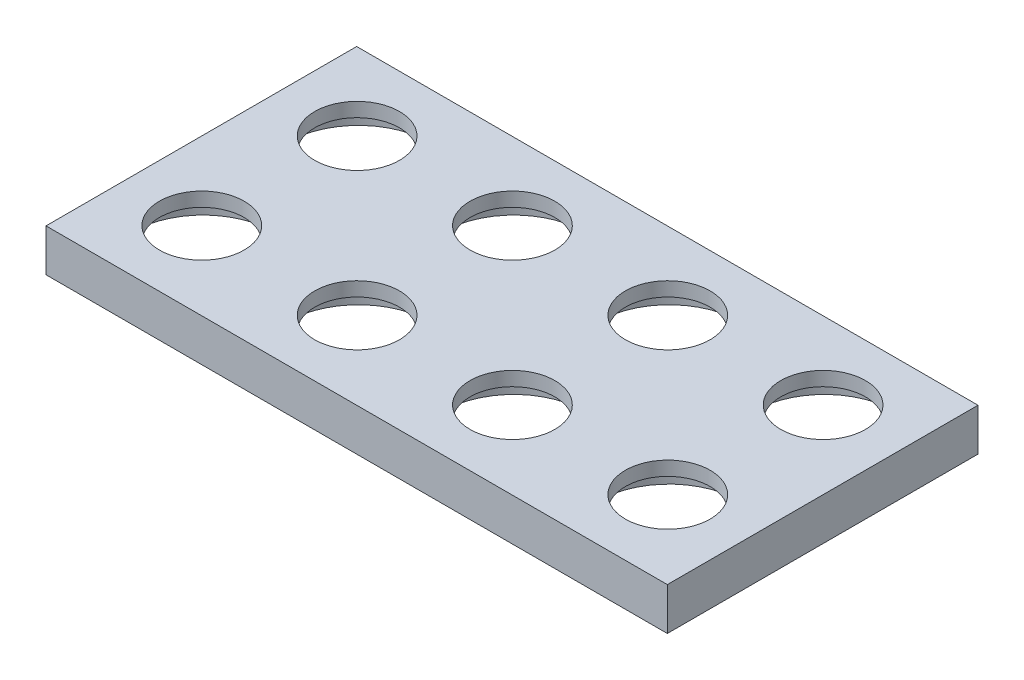
ISO-10303-21;
HEADER;
FILE_DESCRIPTION(('STEP AP214'),'2;1');
FILE_NAME('part.step','',(''),(''),'','','');
FILE_SCHEMA(('AUTOMOTIVE_DESIGN { 1 0 10303 214 1 1 1 1 }'));
ENDSEC;
DATA;
#1=APPLICATION_CONTEXT('core data for automotive mechanical design processes');
#2=APPLICATION_PROTOCOL_DEFINITION('international standard','automotive_design',2000,#1);
#3=PRODUCT_CONTEXT('',#1,'mechanical');
#4=PRODUCT('Part','Part','',(#3));
#5=PRODUCT_RELATED_PRODUCT_CATEGORY('part','',(#4));
#6=PRODUCT_DEFINITION_FORMATION('','',#4);
#7=PRODUCT_DEFINITION_CONTEXT('part definition',#1,'design');
#8=PRODUCT_DEFINITION('design','',#6,#7);
#9=PRODUCT_DEFINITION_SHAPE('','',#8);
#10=(LENGTH_UNIT() NAMED_UNIT(*) SI_UNIT(.MILLI.,.METRE.));
#11=(NAMED_UNIT(*) PLANE_ANGLE_UNIT() SI_UNIT($,.RADIAN.));
#12=(NAMED_UNIT(*) SI_UNIT($,.STERADIAN.) SOLID_ANGLE_UNIT());
#13=UNCERTAINTY_MEASURE_WITH_UNIT(LENGTH_MEASURE(1.E-05),#10,'distance_accuracy_value','');
#14=(GEOMETRIC_REPRESENTATION_CONTEXT(3) GLOBAL_UNCERTAINTY_ASSIGNED_CONTEXT((#13)) GLOBAL_UNIT_ASSIGNED_CONTEXT((#10,
#11,#12)) REPRESENTATION_CONTEXT('',''));
#15=CARTESIAN_POINT('',(0.,0.,0.));
#16=DIRECTION('',(0.,0.,1.));
#17=DIRECTION('',(1.,0.,0.));
#18=AXIS2_PLACEMENT_3D('',#15,#16,#17);
#19=CARTESIAN_POINT('',(22.,-6.,0.));
#20=DIRECTION('',(1.,0.,0.));
#21=DIRECTION('',(0.,0.,-1.));
#22=AXIS2_PLACEMENT_3D('',#19,#20,#21);
#23=PLANE('',#22);
#24=DIRECTION('',(0.,0.,-1.));
#25=VECTOR('',#24,1.);
#26=CARTESIAN_POINT('',(22.,0.,0.));
#27=LINE('',#26,#25);
#28=CARTESIAN_POINT('',(22.,0.,0.));
#29=VERTEX_POINT('',#28);
#30=CARTESIAN_POINT('',(22.,0.,-44.));
#31=VERTEX_POINT('',#30);
#32=EDGE_CURVE('E170',#29,#31,#27,.T.);
#33=ORIENTED_EDGE('',*,*,#32,.F.);
#34=DIRECTION('',(0.,1.,0.));
#35=VECTOR('',#34,1.);
#36=CARTESIAN_POINT('',(22.,-6.,0.));
#37=LINE('',#36,#35);
#38=CARTESIAN_POINT('',(22.,-6.,0.));
#39=VERTEX_POINT('',#38);
#40=EDGE_CURVE('E11',#39,#29,#37,.T.);
#41=ORIENTED_EDGE('',*,*,#40,.F.);
#42=DIRECTION('',(0.,0.,-1.));
#43=VECTOR('',#42,1.);
#44=CARTESIAN_POINT('',(22.,-6.,0.));
#45=LINE('',#44,#43);
#46=CARTESIAN_POINT('',(22.,-6.,-44.));
#47=VERTEX_POINT('',#46);
#48=EDGE_CURVE('E42',#39,#47,#45,.T.);
#49=ORIENTED_EDGE('',*,*,#48,.T.);
#50=DIRECTION('',(0.,1.,0.));
#51=VECTOR('',#50,1.);
#52=CARTESIAN_POINT('',(22.,-6.,-44.));
#53=LINE('',#52,#51);
#54=EDGE_CURVE('E89',#47,#31,#53,.T.);
#55=ORIENTED_EDGE('',*,*,#54,.T.);
#56=EDGE_LOOP('',(#33,#41,#49,#55));
#57=FACE_BOUND('',#56,.T.);
#58=ADVANCED_FACE('F33',(#57),#23,.T.);
#59=CARTESIAN_POINT('',(0.,-6.,0.));
#60=DIRECTION('',(0.,0.,1.));
#61=DIRECTION('',(1.,0.,0.));
#62=AXIS2_PLACEMENT_3D('',#59,#60,#61);
#63=PLANE('',#62);
#64=DIRECTION('',(1.,0.,0.));
#65=VECTOR('',#64,1.);
#66=CARTESIAN_POINT('',(0.,0.,0.));
#67=LINE('',#66,#65);
#68=CARTESIAN_POINT('',(-66.,0.,0.));
#69=VERTEX_POINT('',#68);
#70=EDGE_CURVE('E168',#69,#29,#67,.T.);
#71=ORIENTED_EDGE('',*,*,#70,.F.);
#72=DIRECTION('',(0.,1.,0.));
#73=VECTOR('',#72,1.);
#74=CARTESIAN_POINT('',(-66.,-6.,0.));
#75=LINE('',#74,#73);
#76=CARTESIAN_POINT('',(-66.,-6.,0.));
#77=VERTEX_POINT('',#76);
#78=EDGE_CURVE('E79',#77,#69,#75,.T.);
#79=ORIENTED_EDGE('',*,*,#78,.F.);
#80=DIRECTION('',(1.,0.,0.));
#81=VECTOR('',#80,1.);
#82=CARTESIAN_POINT('',(0.,-6.,0.));
#83=LINE('',#82,#81);
#84=EDGE_CURVE('E74',#77,#39,#83,.T.);
#85=ORIENTED_EDGE('',*,*,#84,.T.);
#86=ORIENTED_EDGE('',*,*,#40,.T.);
#87=EDGE_LOOP('',(#71,#79,#85,#86));
#88=FACE_BOUND('',#87,.T.);
#89=ADVANCED_FACE('F35',(#88),#63,.T.);
#90=CARTESIAN_POINT('',(0.,-6.,0.));
#91=DIRECTION('',(0.,-1.,0.));
#92=DIRECTION('',(0.,0.,-1.));
#93=AXIS2_PLACEMENT_3D('',#90,#91,#92);
#94=PLANE('',#93);
#95=CARTESIAN_POINT('',(-11.,-6.,-33.253914961145));
#96=DIRECTION('',(0.,-1.,0.));
#97=DIRECTION('',(0.,0.,-1.));
#98=AXIS2_PLACEMENT_3D('',#95,#96,#97);
#99=CIRCLE('',#98,10.175);
#100=CARTESIAN_POINT('',(-11.,-6.,-43.428914961145));
#101=VERTEX_POINT('',#100);
#102=EDGE_CURVE('E303',#101,#101,#99,.T.);
#103=ORIENTED_EDGE('',*,*,#102,.F.);
#104=EDGE_LOOP('',(#103));
#105=FACE_BOUND('',#104,.T.);
#106=CARTESIAN_POINT('',(-33.,-6.,-33.253914961145));
#107=DIRECTION('',(0.,-1.,0.));
#108=DIRECTION('',(0.,0.,-1.));
#109=AXIS2_PLACEMENT_3D('',#106,#107,#108);
#110=CIRCLE('',#109,10.175);
#111=CARTESIAN_POINT('',(-33.,-6.,-43.428914961145));
#112=VERTEX_POINT('',#111);
#113=EDGE_CURVE('E324',#112,#112,#110,.T.);
#114=ORIENTED_EDGE('',*,*,#113,.F.);
#115=EDGE_LOOP('',(#114));
#116=FACE_BOUND('',#115,.T.);
#117=CARTESIAN_POINT('',(-55.,-6.,-33.253914961145));
#118=DIRECTION('',(0.,-1.,0.));
#119=DIRECTION('',(0.,0.,-1.));
#120=AXIS2_PLACEMENT_3D('',#117,#118,#119);
#121=CIRCLE('',#120,10.175);
#122=CARTESIAN_POINT('',(-55.,-6.,-43.428914961145));
#123=VERTEX_POINT('',#122);
#124=EDGE_CURVE('E306',#123,#123,#121,.T.);
#125=ORIENTED_EDGE('',*,*,#124,.F.);
#126=EDGE_LOOP('',(#125));
#127=FACE_BOUND('',#126,.T.);
#128=DIRECTION('',(0.,0.,1.));
#129=VECTOR('',#128,1.);
#130=CARTESIAN_POINT('',(-66.,-6.,0.));
#131=LINE('',#130,#129);
#132=CARTESIAN_POINT('',(-66.,-6.,-44.));
#133=VERTEX_POINT('',#132);
#134=EDGE_CURVE('E68',#133,#77,#131,.T.);
#135=ORIENTED_EDGE('',*,*,#134,.F.);
#136=DIRECTION('',(-1.,0.,0.));
#137=VECTOR('',#136,1.);
#138=CARTESIAN_POINT('',(0.,-6.,-44.));
#139=LINE('',#138,#137);
#140=EDGE_CURVE('E72',#47,#133,#139,.T.);
#141=ORIENTED_EDGE('',*,*,#140,.F.);
#142=ORIENTED_EDGE('',*,*,#48,.F.);
#143=ORIENTED_EDGE('',*,*,#84,.F.);
#144=EDGE_LOOP('',(#135,#141,#142,#143));
#145=FACE_BOUND('',#144,.T.);
#146=CARTESIAN_POINT('',(11.,-6.,-33.253914961145));
#147=DIRECTION('',(0.,-1.,0.));
#148=DIRECTION('',(0.,0.,-1.));
#149=AXIS2_PLACEMENT_3D('',#146,#147,#148);
#150=CIRCLE('',#149,10.175);
#151=CARTESIAN_POINT('',(11.,-6.,-43.428914961145));
#152=VERTEX_POINT('',#151);
#153=EDGE_CURVE('E95',#152,#152,#150,.T.);
#154=ORIENTED_EDGE('',*,*,#153,.F.);
#155=EDGE_LOOP('',(#154));
#156=FACE_BOUND('',#155,.T.);
#157=CARTESIAN_POINT('',(-11.,-6.,-11.253914961145));
#158=DIRECTION('',(0.,-1.,0.));
#159=DIRECTION('',(0.,0.,-1.));
#160=AXIS2_PLACEMENT_3D('',#157,#158,#159);
#161=CIRCLE('',#160,10.175);
#162=CARTESIAN_POINT('',(-11.,-6.,-21.428914961145));
#163=VERTEX_POINT('',#162);
#164=EDGE_CURVE('E123',#163,#163,#161,.T.);
#165=ORIENTED_EDGE('',*,*,#164,.F.);
#166=EDGE_LOOP('',(#165));
#167=FACE_BOUND('',#166,.T.);
#168=CARTESIAN_POINT('',(-33.,-6.,-11.253914961145));
#169=DIRECTION('',(0.,-1.,0.));
#170=DIRECTION('',(0.,0.,-1.));
#171=AXIS2_PLACEMENT_3D('',#168,#169,#170);
#172=CIRCLE('',#171,10.175);
#173=CARTESIAN_POINT('',(-33.,-6.,-21.428914961145));
#174=VERTEX_POINT('',#173);
#175=EDGE_CURVE('E129',#174,#174,#172,.T.);
#176=ORIENTED_EDGE('',*,*,#175,.F.);
#177=EDGE_LOOP('',(#176));
#178=FACE_BOUND('',#177,.T.);
#179=CARTESIAN_POINT('',(-55.,-6.,-11.253914961145));
#180=DIRECTION('',(0.,-1.,0.));
#181=DIRECTION('',(0.,0.,-1.));
#182=AXIS2_PLACEMENT_3D('',#179,#180,#181);
#183=CIRCLE('',#182,10.175);
#184=CARTESIAN_POINT('',(-55.,-6.,-21.428914961145));
#185=VERTEX_POINT('',#184);
#186=EDGE_CURVE('E118',#185,#185,#183,.T.);
#187=ORIENTED_EDGE('',*,*,#186,.F.);
#188=EDGE_LOOP('',(#187));
#189=FACE_BOUND('',#188,.T.);
#190=CARTESIAN_POINT('',(11.,-6.,-11.253914961145));
#191=DIRECTION('',(0.,-1.,0.));
#192=DIRECTION('',(0.,0.,-1.));
#193=AXIS2_PLACEMENT_3D('',#190,#191,#192);
#194=CIRCLE('',#193,10.175);
#195=CARTESIAN_POINT('',(11.,-6.,-21.428914961145));
#196=VERTEX_POINT('',#195);
#197=EDGE_CURVE('E156',#196,#196,#194,.T.);
#198=ORIENTED_EDGE('',*,*,#197,.F.);
#199=EDGE_LOOP('',(#198));
#200=FACE_BOUND('',#199,.T.);
#201=ADVANCED_FACE('F70',(#105,#116,#127,#145,#156,#167,#178,#189,#200),#94,.T.);
#202=CARTESIAN_POINT('',(0.,0.,0.));
#203=DIRECTION('',(0.,-1.,0.));
#204=DIRECTION('',(0.,0.,-1.));
#205=AXIS2_PLACEMENT_3D('',#202,#203,#204);
#206=PLANE('',#205);
#207=CARTESIAN_POINT('',(-11.,0.,-33.0622247672438));
#208=DIRECTION('',(0.,1.,0.));
#209=DIRECTION('',(0.,0.,1.));
#210=AXIS2_PLACEMENT_3D('',#207,#208,#209);
#211=CIRCLE('',#210,6.);
#212=CARTESIAN_POINT('',(-11.,0.,-27.0622247672438));
#213=VERTEX_POINT('',#212);
#214=EDGE_CURVE('E96',#213,#213,#211,.T.);
#215=ORIENTED_EDGE('',*,*,#214,.F.);
#216=EDGE_LOOP('',(#215));
#217=FACE_BOUND('',#216,.T.);
#218=CARTESIAN_POINT('',(-33.,0.,-33.0622247672438));
#219=DIRECTION('',(0.,1.,0.));
#220=DIRECTION('',(0.,0.,1.));
#221=AXIS2_PLACEMENT_3D('',#218,#219,#220);
#222=CIRCLE('',#221,6.);
#223=CARTESIAN_POINT('',(-33.,0.,-27.0622247672438));
#224=VERTEX_POINT('',#223);
#225=EDGE_CURVE('E102',#224,#224,#222,.T.);
#226=ORIENTED_EDGE('',*,*,#225,.F.);
#227=EDGE_LOOP('',(#226));
#228=FACE_BOUND('',#227,.T.);
#229=CARTESIAN_POINT('',(-55.,0.,-33.0622247672438));
#230=DIRECTION('',(0.,1.,0.));
#231=DIRECTION('',(0.,0.,1.));
#232=AXIS2_PLACEMENT_3D('',#229,#230,#231);
#233=CIRCLE('',#232,6.);
#234=CARTESIAN_POINT('',(-55.,0.,-27.0622247672438));
#235=VERTEX_POINT('',#234);
#236=EDGE_CURVE('E106',#235,#235,#233,.T.);
#237=ORIENTED_EDGE('',*,*,#236,.F.);
#238=EDGE_LOOP('',(#237));
#239=FACE_BOUND('',#238,.T.);
#240=DIRECTION('',(-1.,0.,0.));
#241=VECTOR('',#240,1.);
#242=CARTESIAN_POINT('',(0.,0.,-44.));
#243=LINE('',#242,#241);
#244=CARTESIAN_POINT('',(-66.,0.,-44.));
#245=VERTEX_POINT('',#244);
#246=EDGE_CURVE('E90',#31,#245,#243,.T.);
#247=ORIENTED_EDGE('',*,*,#246,.T.);
#248=DIRECTION('',(0.,0.,1.));
#249=VECTOR('',#248,1.);
#250=CARTESIAN_POINT('',(-66.,0.,0.));
#251=LINE('',#250,#249);
#252=EDGE_CURVE('E80',#245,#69,#251,.T.);
#253=ORIENTED_EDGE('',*,*,#252,.T.);
#254=ORIENTED_EDGE('',*,*,#70,.T.);
#255=ORIENTED_EDGE('',*,*,#32,.T.);
#256=EDGE_LOOP('',(#247,#253,#254,#255));
#257=FACE_BOUND('',#256,.T.);
#258=CARTESIAN_POINT('',(11.,0.,-33.0622247672438));
#259=DIRECTION('',(0.,1.,0.));
#260=DIRECTION('',(0.,0.,1.));
#261=AXIS2_PLACEMENT_3D('',#258,#259,#260);
#262=CIRCLE('',#261,6.);
#263=CARTESIAN_POINT('',(11.,0.,-27.0622247672438));
#264=VERTEX_POINT('',#263);
#265=EDGE_CURVE('E113',#264,#264,#262,.T.);
#266=ORIENTED_EDGE('',*,*,#265,.F.);
#267=EDGE_LOOP('',(#266));
#268=FACE_BOUND('',#267,.T.);
#269=CARTESIAN_POINT('',(-11.,0.,-11.0622247672438));
#270=DIRECTION('',(0.,1.,0.));
#271=DIRECTION('',(0.,0.,1.));
#272=AXIS2_PLACEMENT_3D('',#269,#270,#271);
#273=CIRCLE('',#272,6.);
#274=CARTESIAN_POINT('',(-11.,0.,-5.06222476724382));
#275=VERTEX_POINT('',#274);
#276=EDGE_CURVE('E140',#275,#275,#273,.T.);
#277=ORIENTED_EDGE('',*,*,#276,.F.);
#278=EDGE_LOOP('',(#277));
#279=FACE_BOUND('',#278,.T.);
#280=CARTESIAN_POINT('',(-33.,0.,-11.0622247672438));
#281=DIRECTION('',(0.,1.,0.));
#282=DIRECTION('',(0.,0.,1.));
#283=AXIS2_PLACEMENT_3D('',#280,#281,#282);
#284=CIRCLE('',#283,6.);
#285=CARTESIAN_POINT('',(-33.,0.,-5.06222476724382));
#286=VERTEX_POINT('',#285);
#287=EDGE_CURVE('E143',#286,#286,#284,.T.);
#288=ORIENTED_EDGE('',*,*,#287,.F.);
#289=EDGE_LOOP('',(#288));
#290=FACE_BOUND('',#289,.T.);
#291=CARTESIAN_POINT('',(-55.,0.,-11.0622247672438));
#292=DIRECTION('',(0.,1.,0.));
#293=DIRECTION('',(0.,0.,1.));
#294=AXIS2_PLACEMENT_3D('',#291,#292,#293);
#295=CIRCLE('',#294,6.);
#296=CARTESIAN_POINT('',(-55.,0.,-5.06222476724381));
#297=VERTEX_POINT('',#296);
#298=EDGE_CURVE('E149',#297,#297,#295,.T.);
#299=ORIENTED_EDGE('',*,*,#298,.F.);
#300=EDGE_LOOP('',(#299));
#301=FACE_BOUND('',#300,.T.);
#302=CARTESIAN_POINT('',(11.,0.,-11.0622247672438));
#303=DIRECTION('',(0.,1.,0.));
#304=DIRECTION('',(0.,0.,1.));
#305=AXIS2_PLACEMENT_3D('',#302,#303,#304);
#306=CIRCLE('',#305,6.);
#307=CARTESIAN_POINT('',(11.,0.,-5.06222476724383));
#308=VERTEX_POINT('',#307);
#309=EDGE_CURVE('E165',#308,#308,#306,.T.);
#310=ORIENTED_EDGE('',*,*,#309,.F.);
#311=EDGE_LOOP('',(#310));
#312=FACE_BOUND('',#311,.T.);
#313=ADVANCED_FACE('F174',(#217,#228,#239,#257,#268,#279,#290,#301,#312),#206,.F.);
#314=CARTESIAN_POINT('',(11.,-2.,-11.0622247672438));
#315=DIRECTION('',(0.,1.,0.));
#316=DIRECTION('',(0.,0.,1.));
#317=AXIS2_PLACEMENT_3D('',#314,#315,#316);
#318=CYLINDRICAL_SURFACE('',#317,6.);
#319=CARTESIAN_POINT('',(11.,-2.,-11.0622247672438));
#320=DIRECTION('',(0.,1.,0.));
#321=DIRECTION('',(0.,0.,1.));
#322=AXIS2_PLACEMENT_3D('',#319,#320,#321);
#323=CIRCLE('',#322,6.);
#324=CARTESIAN_POINT('',(11.,-2.,-5.06222476724383));
#325=VERTEX_POINT('',#324);
#326=EDGE_CURVE('E160',#325,#325,#323,.T.);
#327=ORIENTED_EDGE('',*,*,#326,.F.);
#328=EDGE_LOOP('',(#327));
#329=FACE_BOUND('',#328,.T.);
#330=ORIENTED_EDGE('',*,*,#309,.T.);
#331=EDGE_LOOP('',(#330));
#332=FACE_BOUND('',#331,.T.);
#333=ADVANCED_FACE('F188',(#329,#332),#318,.F.);
#334=CARTESIAN_POINT('',(11.,-2.,-11.253914961145));
#335=DIRECTION('',(0.,-1.,0.));
#336=DIRECTION('',(0.,0.,-1.));
#337=AXIS2_PLACEMENT_3D('',#334,#335,#336);
#338=PLANE('',#337);
#339=CARTESIAN_POINT('',(11.,-2.,-11.253914961145));
#340=DIRECTION('',(0.,-1.,0.));
#341=DIRECTION('',(0.,0.,-1.));
#342=AXIS2_PLACEMENT_3D('',#339,#340,#341);
#343=CIRCLE('',#342,10.175);
#344=CARTESIAN_POINT('',(11.,-2.,-21.428914961145));
#345=VERTEX_POINT('',#344);
#346=EDGE_CURVE('E157',#345,#345,#343,.T.);
#347=ORIENTED_EDGE('',*,*,#346,.T.);
#348=EDGE_LOOP('',(#347));
#349=FACE_BOUND('',#348,.T.);
#350=ORIENTED_EDGE('',*,*,#326,.T.);
#351=EDGE_LOOP('',(#350));
#352=FACE_BOUND('',#351,.T.);
#353=ADVANCED_FACE('F193',(#349,#352),#338,.T.);
#354=CARTESIAN_POINT('',(11.,-2.,-11.253914961145));
#355=DIRECTION('',(0.,-1.,0.));
#356=DIRECTION('',(0.,0.,-1.));
#357=AXIS2_PLACEMENT_3D('',#354,#355,#356);
#358=CYLINDRICAL_SURFACE('',#357,10.175);
#359=ORIENTED_EDGE('',*,*,#346,.F.);
#360=EDGE_LOOP('',(#359));
#361=FACE_BOUND('',#360,.T.);
#362=ORIENTED_EDGE('',*,*,#197,.T.);
#363=EDGE_LOOP('',(#362));
#364=FACE_BOUND('',#363,.T.);
#365=ADVANCED_FACE('F195',(#361,#364),#358,.F.);
#366=CARTESIAN_POINT('',(-66.,-6.,0.));
#367=DIRECTION('',(-1.,0.,0.));
#368=DIRECTION('',(0.,0.,1.));
#369=AXIS2_PLACEMENT_3D('',#366,#367,#368);
#370=PLANE('',#369);
#371=ORIENTED_EDGE('',*,*,#252,.F.);
#372=DIRECTION('',(0.,1.,0.));
#373=VECTOR('',#372,1.);
#374=CARTESIAN_POINT('',(-66.,-6.,-44.));
#375=LINE('',#374,#373);
#376=EDGE_CURVE('E87',#133,#245,#375,.T.);
#377=ORIENTED_EDGE('',*,*,#376,.F.);
#378=ORIENTED_EDGE('',*,*,#134,.T.);
#379=ORIENTED_EDGE('',*,*,#78,.T.);
#380=EDGE_LOOP('',(#371,#377,#378,#379));
#381=FACE_BOUND('',#380,.T.);
#382=ADVANCED_FACE('F92',(#381),#370,.T.);
#383=CARTESIAN_POINT('',(-55.,-2.,-11.0622247672438));
#384=DIRECTION('',(0.,1.,0.));
#385=DIRECTION('',(0.,0.,1.));
#386=AXIS2_PLACEMENT_3D('',#383,#384,#385);
#387=CYLINDRICAL_SURFACE('',#386,6.);
#388=CARTESIAN_POINT('',(-55.,-2.,-11.0622247672438));
#389=DIRECTION('',(0.,1.,0.));
#390=DIRECTION('',(0.,0.,1.));
#391=AXIS2_PLACEMENT_3D('',#388,#389,#390);
#392=CIRCLE('',#391,6.);
#393=CARTESIAN_POINT('',(-55.,-2.,-5.06222476724381));
#394=VERTEX_POINT('',#393);
#395=EDGE_CURVE('E146',#394,#394,#392,.T.);
#396=ORIENTED_EDGE('',*,*,#395,.F.);
#397=EDGE_LOOP('',(#396));
#398=FACE_BOUND('',#397,.T.);
#399=ORIENTED_EDGE('',*,*,#298,.T.);
#400=EDGE_LOOP('',(#399));
#401=FACE_BOUND('',#400,.T.);
#402=ADVANCED_FACE('F204',(#398,#401),#387,.F.);
#403=CARTESIAN_POINT('',(-33.,-2.,-11.0622247672438));
#404=DIRECTION('',(0.,1.,0.));
#405=DIRECTION('',(0.,0.,1.));
#406=AXIS2_PLACEMENT_3D('',#403,#404,#405);
#407=CYLINDRICAL_SURFACE('',#406,6.);
#408=CARTESIAN_POINT('',(-33.,-2.,-11.0622247672438));
#409=DIRECTION('',(0.,1.,0.));
#410=DIRECTION('',(0.,0.,1.));
#411=AXIS2_PLACEMENT_3D('',#408,#409,#410);
#412=CIRCLE('',#411,6.);
#413=CARTESIAN_POINT('',(-33.,-2.,-5.06222476724382));
#414=VERTEX_POINT('',#413);
#415=EDGE_CURVE('E139',#414,#414,#412,.T.);
#416=ORIENTED_EDGE('',*,*,#415,.F.);
#417=EDGE_LOOP('',(#416));
#418=FACE_BOUND('',#417,.T.);
#419=ORIENTED_EDGE('',*,*,#287,.T.);
#420=EDGE_LOOP('',(#419));
#421=FACE_BOUND('',#420,.T.);
#422=ADVANCED_FACE('F207',(#418,#421),#407,.F.);
#423=CARTESIAN_POINT('',(-11.,-2.,-11.0622247672438));
#424=DIRECTION('',(0.,1.,0.));
#425=DIRECTION('',(0.,0.,1.));
#426=AXIS2_PLACEMENT_3D('',#423,#424,#425);
#427=CYLINDRICAL_SURFACE('',#426,6.);
#428=CARTESIAN_POINT('',(-11.,-2.,-11.0622247672438));
#429=DIRECTION('',(0.,1.,0.));
#430=DIRECTION('',(0.,0.,1.));
#431=AXIS2_PLACEMENT_3D('',#428,#429,#430);
#432=CIRCLE('',#431,6.);
#433=CARTESIAN_POINT('',(-11.,-2.,-5.06222476724382));
#434=VERTEX_POINT('',#433);
#435=EDGE_CURVE('E122',#434,#434,#432,.T.);
#436=ORIENTED_EDGE('',*,*,#435,.F.);
#437=EDGE_LOOP('',(#436));
#438=FACE_BOUND('',#437,.T.);
#439=ORIENTED_EDGE('',*,*,#276,.T.);
#440=EDGE_LOOP('',(#439));
#441=FACE_BOUND('',#440,.T.);
#442=ADVANCED_FACE('F211',(#438,#441),#427,.F.);
#443=CARTESIAN_POINT('',(-55.,-2.,-11.253914961145));
#444=DIRECTION('',(0.,-1.,0.));
#445=DIRECTION('',(0.,0.,-1.));
#446=AXIS2_PLACEMENT_3D('',#443,#444,#445);
#447=PLANE('',#446);
#448=CARTESIAN_POINT('',(-55.,-2.,-11.253914961145));
#449=DIRECTION('',(0.,-1.,0.));
#450=DIRECTION('',(0.,0.,-1.));
#451=AXIS2_PLACEMENT_3D('',#448,#449,#450);
#452=CIRCLE('',#451,10.175);
#453=CARTESIAN_POINT('',(-55.,-2.,-21.428914961145));
#454=VERTEX_POINT('',#453);
#455=EDGE_CURVE('E132',#454,#454,#452,.T.);
#456=ORIENTED_EDGE('',*,*,#455,.T.);
#457=EDGE_LOOP('',(#456));
#458=FACE_BOUND('',#457,.T.);
#459=ORIENTED_EDGE('',*,*,#395,.T.);
#460=EDGE_LOOP('',(#459));
#461=FACE_BOUND('',#460,.T.);
#462=ADVANCED_FACE('F215',(#458,#461),#447,.T.);
#463=CARTESIAN_POINT('',(-55.,-2.,-11.253914961145));
#464=DIRECTION('',(0.,-1.,0.));
#465=DIRECTION('',(0.,0.,-1.));
#466=AXIS2_PLACEMENT_3D('',#463,#464,#465);
#467=CYLINDRICAL_SURFACE('',#466,10.175);
#468=ORIENTED_EDGE('',*,*,#455,.F.);
#469=EDGE_LOOP('',(#468));
#470=FACE_BOUND('',#469,.T.);
#471=ORIENTED_EDGE('',*,*,#186,.T.);
#472=EDGE_LOOP('',(#471));
#473=FACE_BOUND('',#472,.T.);
#474=ADVANCED_FACE('F217',(#470,#473),#467,.F.);
#475=CARTESIAN_POINT('',(-33.,-2.,-11.253914961145));
#476=DIRECTION('',(0.,-1.,0.));
#477=DIRECTION('',(0.,0.,-1.));
#478=AXIS2_PLACEMENT_3D('',#475,#476,#477);
#479=PLANE('',#478);
#480=CARTESIAN_POINT('',(-33.,-2.,-11.253914961145));
#481=DIRECTION('',(0.,-1.,0.));
#482=DIRECTION('',(0.,0.,-1.));
#483=AXIS2_PLACEMENT_3D('',#480,#481,#482);
#484=CIRCLE('',#483,10.175);
#485=CARTESIAN_POINT('',(-33.,-2.,-21.428914961145));
#486=VERTEX_POINT('',#485);
#487=EDGE_CURVE('E126',#486,#486,#484,.T.);
#488=ORIENTED_EDGE('',*,*,#487,.T.);
#489=EDGE_LOOP('',(#488));
#490=FACE_BOUND('',#489,.T.);
#491=ORIENTED_EDGE('',*,*,#415,.T.);
#492=EDGE_LOOP('',(#491));
#493=FACE_BOUND('',#492,.T.);
#494=ADVANCED_FACE('F220',(#490,#493),#479,.T.);
#495=CARTESIAN_POINT('',(-33.,-2.,-11.253914961145));
#496=DIRECTION('',(0.,-1.,0.));
#497=DIRECTION('',(0.,0.,-1.));
#498=AXIS2_PLACEMENT_3D('',#495,#496,#497);
#499=CYLINDRICAL_SURFACE('',#498,10.175);
#500=ORIENTED_EDGE('',*,*,#487,.F.);
#501=EDGE_LOOP('',(#500));
#502=FACE_BOUND('',#501,.T.);
#503=ORIENTED_EDGE('',*,*,#175,.T.);
#504=EDGE_LOOP('',(#503));
#505=FACE_BOUND('',#504,.T.);
#506=ADVANCED_FACE('F225',(#502,#505),#499,.F.);
#507=CARTESIAN_POINT('',(-11.,-2.,-11.253914961145));
#508=DIRECTION('',(0.,-1.,0.));
#509=DIRECTION('',(0.,0.,-1.));
#510=AXIS2_PLACEMENT_3D('',#507,#508,#509);
#511=PLANE('',#510);
#512=CARTESIAN_POINT('',(-11.,-2.,-11.253914961145));
#513=DIRECTION('',(0.,-1.,0.));
#514=DIRECTION('',(0.,0.,-1.));
#515=AXIS2_PLACEMENT_3D('',#512,#513,#514);
#516=CIRCLE('',#515,10.175);
#517=CARTESIAN_POINT('',(-11.,-2.,-21.428914961145));
#518=VERTEX_POINT('',#517);
#519=EDGE_CURVE('E119',#518,#518,#516,.T.);
#520=ORIENTED_EDGE('',*,*,#519,.T.);
#521=EDGE_LOOP('',(#520));
#522=FACE_BOUND('',#521,.T.);
#523=ORIENTED_EDGE('',*,*,#435,.T.);
#524=EDGE_LOOP('',(#523));
#525=FACE_BOUND('',#524,.T.);
#526=ADVANCED_FACE('F228',(#522,#525),#511,.T.);
#527=CARTESIAN_POINT('',(-11.,-2.,-11.253914961145));
#528=DIRECTION('',(0.,-1.,0.));
#529=DIRECTION('',(0.,0.,-1.));
#530=AXIS2_PLACEMENT_3D('',#527,#528,#529);
#531=CYLINDRICAL_SURFACE('',#530,10.175);
#532=ORIENTED_EDGE('',*,*,#519,.F.);
#533=EDGE_LOOP('',(#532));
#534=FACE_BOUND('',#533,.T.);
#535=ORIENTED_EDGE('',*,*,#164,.T.);
#536=EDGE_LOOP('',(#535));
#537=FACE_BOUND('',#536,.T.);
#538=ADVANCED_FACE('F233',(#534,#537),#531,.F.);
#539=CARTESIAN_POINT('',(0.,-6.,-44.));
#540=DIRECTION('',(0.,0.,-1.));
#541=DIRECTION('',(-1.,0.,0.));
#542=AXIS2_PLACEMENT_3D('',#539,#540,#541);
#543=PLANE('',#542);
#544=ORIENTED_EDGE('',*,*,#246,.F.);
#545=ORIENTED_EDGE('',*,*,#54,.F.);
#546=ORIENTED_EDGE('',*,*,#140,.T.);
#547=ORIENTED_EDGE('',*,*,#376,.T.);
#548=EDGE_LOOP('',(#544,#545,#546,#547));
#549=FACE_BOUND('',#548,.T.);
#550=ADVANCED_FACE('F86',(#549),#543,.T.);
#551=CARTESIAN_POINT('',(11.,-2.,-33.0622247672438));
#552=DIRECTION('',(0.,1.,0.));
#553=DIRECTION('',(0.,0.,1.));
#554=AXIS2_PLACEMENT_3D('',#551,#552,#553);
#555=CYLINDRICAL_SURFACE('',#554,6.);
#556=CARTESIAN_POINT('',(11.,-2.,-33.0622247672438));
#557=DIRECTION('',(0.,1.,0.));
#558=DIRECTION('',(0.,0.,1.));
#559=AXIS2_PLACEMENT_3D('',#556,#557,#558);
#560=CIRCLE('',#559,6.);
#561=CARTESIAN_POINT('',(11.,-2.,-27.0622247672438));
#562=VERTEX_POINT('',#561);
#563=EDGE_CURVE('E109',#562,#562,#560,.T.);
#564=ORIENTED_EDGE('',*,*,#563,.F.);
#565=EDGE_LOOP('',(#564));
#566=FACE_BOUND('',#565,.T.);
#567=ORIENTED_EDGE('',*,*,#265,.T.);
#568=EDGE_LOOP('',(#567));
#569=FACE_BOUND('',#568,.T.);
#570=ADVANCED_FACE('F242',(#566,#569),#555,.F.);
#571=CARTESIAN_POINT('',(11.,-2.,-33.253914961145));
#572=DIRECTION('',(0.,-1.,0.));
#573=DIRECTION('',(0.,0.,-1.));
#574=AXIS2_PLACEMENT_3D('',#571,#572,#573);
#575=PLANE('',#574);
#576=CARTESIAN_POINT('',(11.,-2.,-33.253914961145));
#577=DIRECTION('',(0.,-1.,0.));
#578=DIRECTION('',(0.,0.,-1.));
#579=AXIS2_PLACEMENT_3D('',#576,#577,#578);
#580=CIRCLE('',#579,10.175);
#581=CARTESIAN_POINT('',(11.,-2.,-43.428914961145));
#582=VERTEX_POINT('',#581);
#583=EDGE_CURVE('E99',#582,#582,#580,.T.);
#584=ORIENTED_EDGE('',*,*,#583,.T.);
#585=EDGE_LOOP('',(#584));
#586=FACE_BOUND('',#585,.T.);
#587=ORIENTED_EDGE('',*,*,#563,.T.);
#588=EDGE_LOOP('',(#587));
#589=FACE_BOUND('',#588,.T.);
#590=ADVANCED_FACE('F245',(#586,#589),#575,.T.);
#591=CARTESIAN_POINT('',(11.,-2.,-33.253914961145));
#592=DIRECTION('',(0.,-1.,0.));
#593=DIRECTION('',(0.,0.,-1.));
#594=AXIS2_PLACEMENT_3D('',#591,#592,#593);
#595=CYLINDRICAL_SURFACE('',#594,10.175);
#596=ORIENTED_EDGE('',*,*,#583,.F.);
#597=EDGE_LOOP('',(#596));
#598=FACE_BOUND('',#597,.T.);
#599=ORIENTED_EDGE('',*,*,#153,.T.);
#600=EDGE_LOOP('',(#599));
#601=FACE_BOUND('',#600,.T.);
#602=ADVANCED_FACE('F247',(#598,#601),#595,.F.);
#603=CARTESIAN_POINT('',(-55.,-2.,-33.0622247672438));
#604=DIRECTION('',(0.,1.,0.));
#605=DIRECTION('',(0.,0.,1.));
#606=AXIS2_PLACEMENT_3D('',#603,#604,#605);
#607=CYLINDRICAL_SURFACE('',#606,6.);
#608=CARTESIAN_POINT('',(-55.,-2.,-33.0622247672438));
#609=DIRECTION('',(0.,1.,0.));
#610=DIRECTION('',(0.,0.,1.));
#611=AXIS2_PLACEMENT_3D('',#608,#609,#610);
#612=CIRCLE('',#611,6.);
#613=CARTESIAN_POINT('',(-55.,-2.,-27.0622247672438));
#614=VERTEX_POINT('',#613);
#615=EDGE_CURVE('E301',#614,#614,#612,.T.);
#616=ORIENTED_EDGE('',*,*,#615,.F.);
#617=EDGE_LOOP('',(#616));
#618=FACE_BOUND('',#617,.T.);
#619=ORIENTED_EDGE('',*,*,#236,.T.);
#620=EDGE_LOOP('',(#619));
#621=FACE_BOUND('',#620,.T.);
#622=ADVANCED_FACE('F250',(#618,#621),#607,.F.);
#623=CARTESIAN_POINT('',(-33.,-2.,-33.0622247672438));
#624=DIRECTION('',(0.,1.,0.));
#625=DIRECTION('',(0.,0.,1.));
#626=AXIS2_PLACEMENT_3D('',#623,#624,#625);
#627=CYLINDRICAL_SURFACE('',#626,6.);
#628=CARTESIAN_POINT('',(-33.,-2.,-33.0622247672438));
#629=DIRECTION('',(0.,1.,0.));
#630=DIRECTION('',(0.,0.,1.));
#631=AXIS2_PLACEMENT_3D('',#628,#629,#630);
#632=CIRCLE('',#631,6.);
#633=CARTESIAN_POINT('',(-33.,-2.,-27.0622247672438));
#634=VERTEX_POINT('',#633);
#635=EDGE_CURVE('E298',#634,#634,#632,.T.);
#636=ORIENTED_EDGE('',*,*,#635,.F.);
#637=EDGE_LOOP('',(#636));
#638=FACE_BOUND('',#637,.T.);
#639=ORIENTED_EDGE('',*,*,#225,.T.);
#640=EDGE_LOOP('',(#639));
#641=FACE_BOUND('',#640,.T.);
#642=ADVANCED_FACE('F257',(#638,#641),#627,.F.);
#643=CARTESIAN_POINT('',(-11.,-2.,-33.0622247672438));
#644=DIRECTION('',(0.,1.,0.));
#645=DIRECTION('',(0.,0.,1.));
#646=AXIS2_PLACEMENT_3D('',#643,#644,#645);
#647=CYLINDRICAL_SURFACE('',#646,6.);
#648=CARTESIAN_POINT('',(-11.,-2.,-33.0622247672438));
#649=DIRECTION('',(0.,1.,0.));
#650=DIRECTION('',(0.,0.,1.));
#651=AXIS2_PLACEMENT_3D('',#648,#649,#650);
#652=CIRCLE('',#651,6.);
#653=CARTESIAN_POINT('',(-11.,-2.,-27.0622247672438));
#654=VERTEX_POINT('',#653);
#655=EDGE_CURVE('E297',#654,#654,#652,.T.);
#656=ORIENTED_EDGE('',*,*,#655,.F.);
#657=EDGE_LOOP('',(#656));
#658=FACE_BOUND('',#657,.T.);
#659=ORIENTED_EDGE('',*,*,#214,.T.);
#660=EDGE_LOOP('',(#659));
#661=FACE_BOUND('',#660,.T.);
#662=ADVANCED_FACE('F261',(#658,#661),#647,.F.);
#663=CARTESIAN_POINT('',(-55.,-2.,-33.253914961145));
#664=DIRECTION('',(0.,-1.,0.));
#665=DIRECTION('',(0.,0.,-1.));
#666=AXIS2_PLACEMENT_3D('',#663,#664,#665);
#667=PLANE('',#666);
#668=CARTESIAN_POINT('',(-55.,-2.,-33.253914961145));
#669=DIRECTION('',(0.,-1.,0.));
#670=DIRECTION('',(0.,0.,-1.));
#671=AXIS2_PLACEMENT_3D('',#668,#669,#670);
#672=CIRCLE('',#671,10.175);
#673=CARTESIAN_POINT('',(-55.,-2.,-43.428914961145));
#674=VERTEX_POINT('',#673);
#675=EDGE_CURVE('E321',#674,#674,#672,.T.);
#676=ORIENTED_EDGE('',*,*,#675,.T.);
#677=EDGE_LOOP('',(#676));
#678=FACE_BOUND('',#677,.T.);
#679=ORIENTED_EDGE('',*,*,#615,.T.);
#680=EDGE_LOOP('',(#679));
#681=FACE_BOUND('',#680,.T.);
#682=ADVANCED_FACE('F265',(#678,#681),#667,.T.);
#683=CARTESIAN_POINT('',(-55.,-2.,-33.253914961145));
#684=DIRECTION('',(0.,-1.,0.));
#685=DIRECTION('',(0.,0.,-1.));
#686=AXIS2_PLACEMENT_3D('',#683,#684,#685);
#687=CYLINDRICAL_SURFACE('',#686,10.175);
#688=ORIENTED_EDGE('',*,*,#675,.F.);
#689=EDGE_LOOP('',(#688));
#690=FACE_BOUND('',#689,.T.);
#691=ORIENTED_EDGE('',*,*,#124,.T.);
#692=EDGE_LOOP('',(#691));
#693=FACE_BOUND('',#692,.T.);
#694=ADVANCED_FACE('F267',(#690,#693),#687,.F.);
#695=CARTESIAN_POINT('',(-33.,-2.,-33.253914961145));
#696=DIRECTION('',(0.,-1.,0.));
#697=DIRECTION('',(0.,0.,-1.));
#698=AXIS2_PLACEMENT_3D('',#695,#696,#697);
#699=PLANE('',#698);
#700=CARTESIAN_POINT('',(-33.,-2.,-33.253914961145));
#701=DIRECTION('',(0.,-1.,0.));
#702=DIRECTION('',(0.,0.,-1.));
#703=AXIS2_PLACEMENT_3D('',#700,#701,#702);
#704=CIRCLE('',#703,10.175);
#705=CARTESIAN_POINT('',(-33.,-2.,-43.428914961145));
#706=VERTEX_POINT('',#705);
#707=EDGE_CURVE('E327',#706,#706,#704,.T.);
#708=ORIENTED_EDGE('',*,*,#707,.T.);
#709=EDGE_LOOP('',(#708));
#710=FACE_BOUND('',#709,.T.);
#711=ORIENTED_EDGE('',*,*,#635,.T.);
#712=EDGE_LOOP('',(#711));
#713=FACE_BOUND('',#712,.T.);
#714=ADVANCED_FACE('F270',(#710,#713),#699,.T.);
#715=CARTESIAN_POINT('',(-33.,-2.,-33.253914961145));
#716=DIRECTION('',(0.,-1.,0.));
#717=DIRECTION('',(0.,0.,-1.));
#718=AXIS2_PLACEMENT_3D('',#715,#716,#717);
#719=CYLINDRICAL_SURFACE('',#718,10.175);
#720=ORIENTED_EDGE('',*,*,#707,.F.);
#721=EDGE_LOOP('',(#720));
#722=FACE_BOUND('',#721,.T.);
#723=ORIENTED_EDGE('',*,*,#113,.T.);
#724=EDGE_LOOP('',(#723));
#725=FACE_BOUND('',#724,.T.);
#726=ADVANCED_FACE('F275',(#722,#725),#719,.F.);
#727=CARTESIAN_POINT('',(-11.,-2.,-33.253914961145));
#728=DIRECTION('',(0.,-1.,0.));
#729=DIRECTION('',(0.,0.,-1.));
#730=AXIS2_PLACEMENT_3D('',#727,#728,#729);
#731=PLANE('',#730);
#732=CARTESIAN_POINT('',(-11.,-2.,-33.253914961145));
#733=DIRECTION('',(0.,-1.,0.));
#734=DIRECTION('',(0.,0.,-1.));
#735=AXIS2_PLACEMENT_3D('',#732,#733,#734);
#736=CIRCLE('',#735,10.175);
#737=CARTESIAN_POINT('',(-11.,-2.,-43.428914961145));
#738=VERTEX_POINT('',#737);
#739=EDGE_CURVE('E294',#738,#738,#736,.T.);
#740=ORIENTED_EDGE('',*,*,#739,.T.);
#741=EDGE_LOOP('',(#740));
#742=FACE_BOUND('',#741,.T.);
#743=ORIENTED_EDGE('',*,*,#655,.T.);
#744=EDGE_LOOP('',(#743));
#745=FACE_BOUND('',#744,.T.);
#746=ADVANCED_FACE('F278',(#742,#745),#731,.T.);
#747=CARTESIAN_POINT('',(-11.,-2.,-33.253914961145));
#748=DIRECTION('',(0.,-1.,0.));
#749=DIRECTION('',(0.,0.,-1.));
#750=AXIS2_PLACEMENT_3D('',#747,#748,#749);
#751=CYLINDRICAL_SURFACE('',#750,10.175);
#752=ORIENTED_EDGE('',*,*,#739,.F.);
#753=EDGE_LOOP('',(#752));
#754=FACE_BOUND('',#753,.T.);
#755=ORIENTED_EDGE('',*,*,#102,.T.);
#756=EDGE_LOOP('',(#755));
#757=FACE_BOUND('',#756,.T.);
#758=ADVANCED_FACE('F283',(#754,#757),#751,.F.);
#759=CLOSED_SHELL('',(#58,#89,#201,#313,#333,#353,#365,#382,#402,#422,#442,#462,#474,#494,#506,
#526,#538,#550,#570,#590,#602,#622,#642,#662,#682,#694,#714,#726,#746,#758));
#760=MANIFOLD_SOLID_BREP('B2',#759);
#761=ADVANCED_BREP_SHAPE_REPRESENTATION('',(#18,#760),#14);
#762=SHAPE_DEFINITION_REPRESENTATION(#9,#761);
ENDSEC;
END-ISO-10303-21;
